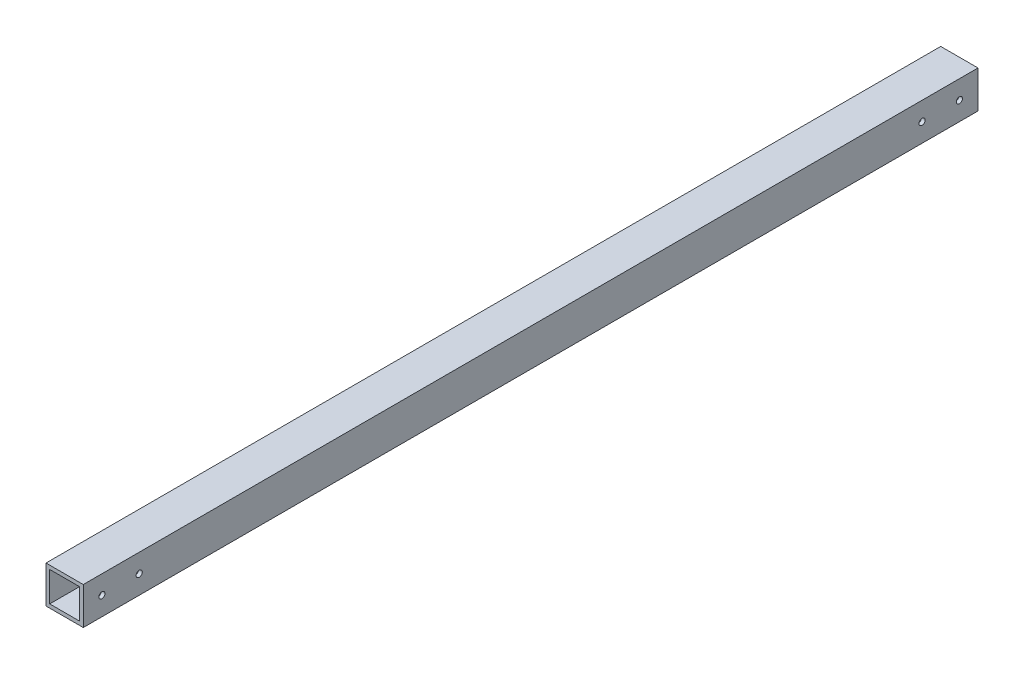
ISO-10303-21;
HEADER;
FILE_DESCRIPTION(('STEP AP214'),'2;1');
FILE_NAME('part.step','',(''),(''),'','','');
FILE_SCHEMA(('AUTOMOTIVE_DESIGN { 1 0 10303 214 1 1 1 1 }'));
ENDSEC;
DATA;
#1=APPLICATION_CONTEXT('core data for automotive mechanical design processes');
#2=APPLICATION_PROTOCOL_DEFINITION('international standard','automotive_design',2000,#1);
#3=PRODUCT_CONTEXT('',#1,'mechanical');
#4=PRODUCT('Part','Part','',(#3));
#5=PRODUCT_RELATED_PRODUCT_CATEGORY('part','',(#4));
#6=PRODUCT_DEFINITION_FORMATION('','',#4);
#7=PRODUCT_DEFINITION_CONTEXT('part definition',#1,'design');
#8=PRODUCT_DEFINITION('design','',#6,#7);
#9=PRODUCT_DEFINITION_SHAPE('','',#8);
#10=(LENGTH_UNIT() NAMED_UNIT(*) SI_UNIT(.MILLI.,.METRE.));
#11=(NAMED_UNIT(*) PLANE_ANGLE_UNIT() SI_UNIT($,.RADIAN.));
#12=(NAMED_UNIT(*) SI_UNIT($,.STERADIAN.) SOLID_ANGLE_UNIT());
#13=UNCERTAINTY_MEASURE_WITH_UNIT(LENGTH_MEASURE(1.E-05),#10,'distance_accuracy_value','');
#14=(GEOMETRIC_REPRESENTATION_CONTEXT(3) GLOBAL_UNCERTAINTY_ASSIGNED_CONTEXT((#13)) GLOBAL_UNIT_ASSIGNED_CONTEXT((#10,
#11,#12)) REPRESENTATION_CONTEXT('',''));
#15=CARTESIAN_POINT('',(0.,0.,0.));
#16=DIRECTION('',(0.,0.,1.));
#17=DIRECTION('',(1.,0.,0.));
#18=AXIS2_PLACEMENT_3D('',#15,#16,#17);
#19=CARTESIAN_POINT('',(10.,10.,560.));
#20=DIRECTION('',(-1.,0.,0.));
#21=DIRECTION('',(0.,0.,1.));
#22=AXIS2_PLACEMENT_3D('',#19,#20,#21);
#23=PLANE('',#22);
#24=CARTESIAN_POINT('',(10.,0.,50.));
#25=DIRECTION('',(1.,0.,0.));
#26=DIRECTION('',(0.,0.,-1.));
#27=AXIS2_PLACEMENT_3D('',#24,#25,#26);
#28=CIRCLE('',#27,1.64999999999999);
#29=CARTESIAN_POINT('',(10.,0.,48.35));
#30=VERTEX_POINT('',#29);
#31=EDGE_CURVE('E232',#30,#30,#28,.T.);
#32=ORIENTED_EDGE('',*,*,#31,.F.);
#33=EDGE_LOOP('',(#32));
#34=FACE_BOUND('',#33,.T.);
#35=CARTESIAN_POINT('',(10.,0.,70.));
#36=DIRECTION('',(1.,0.,0.));
#37=DIRECTION('',(0.,0.,-1.));
#38=AXIS2_PLACEMENT_3D('',#35,#36,#37);
#39=CIRCLE('',#38,1.64999999999999);
#40=CARTESIAN_POINT('',(10.,0.,68.3500000000001));
#41=VERTEX_POINT('',#40);
#42=EDGE_CURVE('E160',#41,#41,#39,.T.);
#43=ORIENTED_EDGE('',*,*,#42,.F.);
#44=EDGE_LOOP('',(#43));
#45=FACE_BOUND('',#44,.T.);
#46=CARTESIAN_POINT('',(10.,0.,490.));
#47=DIRECTION('',(1.,0.,0.));
#48=DIRECTION('',(0.,0.,-1.));
#49=AXIS2_PLACEMENT_3D('',#46,#47,#48);
#50=CIRCLE('',#49,1.64999999999999);
#51=CARTESIAN_POINT('',(10.,0.,488.35));
#52=VERTEX_POINT('',#51);
#53=EDGE_CURVE('E149',#52,#52,#50,.T.);
#54=ORIENTED_EDGE('',*,*,#53,.F.);
#55=EDGE_LOOP('',(#54));
#56=FACE_BOUND('',#55,.T.);
#57=CARTESIAN_POINT('',(10.,0.,510.));
#58=DIRECTION('',(1.,0.,0.));
#59=DIRECTION('',(0.,0.,-1.));
#60=AXIS2_PLACEMENT_3D('',#57,#58,#59);
#61=CIRCLE('',#60,1.64999999999999);
#62=CARTESIAN_POINT('',(10.,0.,508.35));
#63=VERTEX_POINT('',#62);
#64=EDGE_CURVE('E148',#63,#63,#61,.T.);
#65=ORIENTED_EDGE('',*,*,#64,.F.);
#66=EDGE_LOOP('',(#65));
#67=FACE_BOUND('',#66,.T.);
#68=DIRECTION('',(0.,1.,0.));
#69=VECTOR('',#68,1.);
#70=CARTESIAN_POINT('',(10.,10.,520.));
#71=LINE('',#70,#69);
#72=CARTESIAN_POINT('',(10.,-10.,520.));
#73=VERTEX_POINT('',#72);
#74=CARTESIAN_POINT('',(10.,10.,520.));
#75=VERTEX_POINT('',#74);
#76=EDGE_CURVE('E173',#73,#75,#71,.T.);
#77=ORIENTED_EDGE('',*,*,#76,.F.);
#78=DIRECTION('',(0.,0.,-1.));
#79=VECTOR('',#78,1.);
#80=CARTESIAN_POINT('',(10.,-10.,560.));
#81=LINE('',#80,#79);
#82=CARTESIAN_POINT('',(10.,-10.,40.));
#83=VERTEX_POINT('',#82);
#84=EDGE_CURVE('E138',#73,#83,#81,.T.);
#85=ORIENTED_EDGE('',*,*,#84,.T.);
#86=DIRECTION('',(0.,1.,0.));
#87=VECTOR('',#86,1.);
#88=CARTESIAN_POINT('',(10.,10.,40.));
#89=LINE('',#88,#87);
#90=CARTESIAN_POINT('',(10.,10.,40.));
#91=VERTEX_POINT('',#90);
#92=EDGE_CURVE('E133',#83,#91,#89,.T.);
#93=ORIENTED_EDGE('',*,*,#92,.T.);
#94=DIRECTION('',(0.,0.,-1.));
#95=VECTOR('',#94,1.);
#96=CARTESIAN_POINT('',(10.,10.,560.));
#97=LINE('',#96,#95);
#98=EDGE_CURVE('E144',#75,#91,#97,.T.);
#99=ORIENTED_EDGE('',*,*,#98,.F.);
#100=EDGE_LOOP('',(#77,#85,#93,#99));
#101=FACE_BOUND('',#100,.T.);
#102=ADVANCED_FACE('F47',(#34,#45,#56,#67,#101),#23,.F.);
#103=CARTESIAN_POINT('',(-10.,10.,560.));
#104=DIRECTION('',(0.,-1.,0.));
#105=DIRECTION('',(1.,0.,0.));
#106=AXIS2_PLACEMENT_3D('',#103,#104,#105);
#107=PLANE('',#106);
#108=DIRECTION('',(-1.,0.,0.));
#109=VECTOR('',#108,1.);
#110=CARTESIAN_POINT('',(-10.,10.,520.));
#111=LINE('',#110,#109);
#112=CARTESIAN_POINT('',(-10.,10.,520.));
#113=VERTEX_POINT('',#112);
#114=EDGE_CURVE('E171',#75,#113,#111,.T.);
#115=ORIENTED_EDGE('',*,*,#114,.F.);
#116=ORIENTED_EDGE('',*,*,#98,.T.);
#117=DIRECTION('',(-1.,0.,0.));
#118=VECTOR('',#117,1.);
#119=CARTESIAN_POINT('',(-10.,10.,40.));
#120=LINE('',#119,#118);
#121=CARTESIAN_POINT('',(-10.,10.,40.));
#122=VERTEX_POINT('',#121);
#123=EDGE_CURVE('E189',#91,#122,#120,.T.);
#124=ORIENTED_EDGE('',*,*,#123,.T.);
#125=DIRECTION('',(0.,0.,-1.));
#126=VECTOR('',#125,1.);
#127=CARTESIAN_POINT('',(-10.,10.,560.));
#128=LINE('',#127,#126);
#129=EDGE_CURVE('E142',#113,#122,#128,.T.);
#130=ORIENTED_EDGE('',*,*,#129,.F.);
#131=EDGE_LOOP('',(#115,#116,#124,#130));
#132=FACE_BOUND('',#131,.T.);
#133=ADVANCED_FACE('F210',(#132),#107,.F.);
#134=CARTESIAN_POINT('',(-10.,10.,560.));
#135=DIRECTION('',(1.,0.,0.));
#136=DIRECTION('',(0.,1.,0.));
#137=AXIS2_PLACEMENT_3D('',#134,#135,#136);
#138=PLANE('',#137);
#139=DIRECTION('',(0.,-1.,0.));
#140=VECTOR('',#139,1.);
#141=CARTESIAN_POINT('',(-10.,10.,520.));
#142=LINE('',#141,#140);
#143=CARTESIAN_POINT('',(-10.,-10.,520.));
#144=VERTEX_POINT('',#143);
#145=EDGE_CURVE('E63',#113,#144,#142,.T.);
#146=ORIENTED_EDGE('',*,*,#145,.F.);
#147=ORIENTED_EDGE('',*,*,#129,.T.);
#148=DIRECTION('',(0.,-1.,0.));
#149=VECTOR('',#148,1.);
#150=CARTESIAN_POINT('',(-10.,10.,40.));
#151=LINE('',#150,#149);
#152=CARTESIAN_POINT('',(-10.,-10.,40.));
#153=VERTEX_POINT('',#152);
#154=EDGE_CURVE('E186',#122,#153,#151,.T.);
#155=ORIENTED_EDGE('',*,*,#154,.T.);
#156=DIRECTION('',(0.,0.,-1.));
#157=VECTOR('',#156,1.);
#158=CARTESIAN_POINT('',(-10.,-10.,560.));
#159=LINE('',#158,#157);
#160=EDGE_CURVE('E140',#144,#153,#159,.T.);
#161=ORIENTED_EDGE('',*,*,#160,.F.);
#162=EDGE_LOOP('',(#146,#147,#155,#161));
#163=FACE_BOUND('',#162,.T.);
#164=ADVANCED_FACE('F206',(#163),#138,.F.);
#165=CARTESIAN_POINT('',(-10.,-10.,560.));
#166=DIRECTION('',(0.,1.,0.));
#167=DIRECTION('',(0.,0.,1.));
#168=AXIS2_PLACEMENT_3D('',#165,#166,#167);
#169=PLANE('',#168);
#170=DIRECTION('',(1.,0.,0.));
#171=VECTOR('',#170,1.);
#172=CARTESIAN_POINT('',(-10.,-10.,520.));
#173=LINE('',#172,#171);
#174=EDGE_CURVE('E168',#144,#73,#173,.T.);
#175=ORIENTED_EDGE('',*,*,#174,.F.);
#176=ORIENTED_EDGE('',*,*,#160,.T.);
#177=DIRECTION('',(1.,0.,0.));
#178=VECTOR('',#177,1.);
#179=CARTESIAN_POINT('',(-10.,-10.,40.));
#180=LINE('',#179,#178);
#181=EDGE_CURVE('E183',#153,#83,#180,.T.);
#182=ORIENTED_EDGE('',*,*,#181,.T.);
#183=ORIENTED_EDGE('',*,*,#84,.F.);
#184=EDGE_LOOP('',(#175,#176,#182,#183));
#185=FACE_BOUND('',#184,.T.);
#186=ADVANCED_FACE('F203',(#185),#169,.F.);
#187=CARTESIAN_POINT('',(8.,8.,560.));
#188=DIRECTION('',(-1.,0.,0.));
#189=DIRECTION('',(0.,0.,1.));
#190=AXIS2_PLACEMENT_3D('',#187,#188,#189);
#191=PLANE('',#190);
#192=CARTESIAN_POINT('',(8.,0.,50.));
#193=DIRECTION('',(-1.,0.,0.));
#194=DIRECTION('',(0.,0.,1.));
#195=AXIS2_PLACEMENT_3D('',#192,#193,#194);
#196=CIRCLE('',#195,1.64999999999999);
#197=CARTESIAN_POINT('',(8.,0.,51.65));
#198=VERTEX_POINT('',#197);
#199=EDGE_CURVE('E50',#198,#198,#196,.T.);
#200=ORIENTED_EDGE('',*,*,#199,.F.);
#201=EDGE_LOOP('',(#200));
#202=FACE_BOUND('',#201,.T.);
#203=CARTESIAN_POINT('',(8.,0.,70.));
#204=DIRECTION('',(-1.,0.,0.));
#205=DIRECTION('',(0.,0.,1.));
#206=AXIS2_PLACEMENT_3D('',#203,#204,#205);
#207=CIRCLE('',#206,1.64999999999999);
#208=CARTESIAN_POINT('',(8.,0.,71.65));
#209=VERTEX_POINT('',#208);
#210=EDGE_CURVE('E155',#209,#209,#207,.T.);
#211=ORIENTED_EDGE('',*,*,#210,.F.);
#212=EDGE_LOOP('',(#211));
#213=FACE_BOUND('',#212,.T.);
#214=CARTESIAN_POINT('',(8.,0.,490.));
#215=DIRECTION('',(-1.,0.,0.));
#216=DIRECTION('',(0.,0.,1.));
#217=AXIS2_PLACEMENT_3D('',#214,#215,#216);
#218=CIRCLE('',#217,1.64999999999999);
#219=CARTESIAN_POINT('',(8.,0.,491.65));
#220=VERTEX_POINT('',#219);
#221=EDGE_CURVE('E146',#220,#220,#218,.T.);
#222=ORIENTED_EDGE('',*,*,#221,.F.);
#223=EDGE_LOOP('',(#222));
#224=FACE_BOUND('',#223,.T.);
#225=CARTESIAN_POINT('',(8.,0.,510.));
#226=DIRECTION('',(-1.,0.,0.));
#227=DIRECTION('',(0.,0.,1.));
#228=AXIS2_PLACEMENT_3D('',#225,#226,#227);
#229=CIRCLE('',#228,1.64999999999999);
#230=CARTESIAN_POINT('',(8.,0.,511.65));
#231=VERTEX_POINT('',#230);
#232=EDGE_CURVE('E124',#231,#231,#229,.T.);
#233=ORIENTED_EDGE('',*,*,#232,.F.);
#234=EDGE_LOOP('',(#233));
#235=FACE_BOUND('',#234,.T.);
#236=DIRECTION('',(0.,0.,-1.));
#237=VECTOR('',#236,1.);
#238=CARTESIAN_POINT('',(8.,-8.,560.));
#239=LINE('',#238,#237);
#240=CARTESIAN_POINT('',(8.,-8.,520.));
#241=VERTEX_POINT('',#240);
#242=CARTESIAN_POINT('',(8.,-8.,40.));
#243=VERTEX_POINT('',#242);
#244=EDGE_CURVE('E129',#241,#243,#239,.T.);
#245=ORIENTED_EDGE('',*,*,#244,.F.);
#246=DIRECTION('',(0.,1.,0.));
#247=VECTOR('',#246,1.);
#248=CARTESIAN_POINT('',(8.,8.,520.));
#249=LINE('',#248,#247);
#250=CARTESIAN_POINT('',(8.,8.,520.));
#251=VERTEX_POINT('',#250);
#252=EDGE_CURVE('E71',#241,#251,#249,.T.);
#253=ORIENTED_EDGE('',*,*,#252,.T.);
#254=DIRECTION('',(0.,0.,-1.));
#255=VECTOR('',#254,1.);
#256=CARTESIAN_POINT('',(8.,8.,560.));
#257=LINE('',#256,#255);
#258=CARTESIAN_POINT('',(8.,8.,40.));
#259=VERTEX_POINT('',#258);
#260=EDGE_CURVE('E131',#251,#259,#257,.T.);
#261=ORIENTED_EDGE('',*,*,#260,.T.);
#262=DIRECTION('',(0.,1.,0.));
#263=VECTOR('',#262,1.);
#264=CARTESIAN_POINT('',(8.,8.,40.));
#265=LINE('',#264,#263);
#266=EDGE_CURVE('E180',#243,#259,#265,.T.);
#267=ORIENTED_EDGE('',*,*,#266,.F.);
#268=EDGE_LOOP('',(#245,#253,#261,#267));
#269=FACE_BOUND('',#268,.T.);
#270=ADVANCED_FACE('F314',(#202,#213,#224,#235,#269),#191,.T.);
#271=CARTESIAN_POINT('',(-8.,8.,560.));
#272=DIRECTION('',(0.,-1.,0.));
#273=DIRECTION('',(0.,0.,-1.));
#274=AXIS2_PLACEMENT_3D('',#271,#272,#273);
#275=PLANE('',#274);
#276=ORIENTED_EDGE('',*,*,#260,.F.);
#277=DIRECTION('',(-1.,0.,0.));
#278=VECTOR('',#277,1.);
#279=CARTESIAN_POINT('',(-8.,8.,520.));
#280=LINE('',#279,#278);
#281=CARTESIAN_POINT('',(-8.,8.,520.));
#282=VERTEX_POINT('',#281);
#283=EDGE_CURVE('E123',#251,#282,#280,.T.);
#284=ORIENTED_EDGE('',*,*,#283,.T.);
#285=DIRECTION('',(0.,0.,-1.));
#286=VECTOR('',#285,1.);
#287=CARTESIAN_POINT('',(-8.,8.,560.));
#288=LINE('',#287,#286);
#289=CARTESIAN_POINT('',(-8.,8.,40.));
#290=VERTEX_POINT('',#289);
#291=EDGE_CURVE('E122',#282,#290,#288,.T.);
#292=ORIENTED_EDGE('',*,*,#291,.T.);
#293=DIRECTION('',(-1.,0.,0.));
#294=VECTOR('',#293,1.);
#295=CARTESIAN_POINT('',(-8.,8.,40.));
#296=LINE('',#295,#294);
#297=EDGE_CURVE('E177',#259,#290,#296,.T.);
#298=ORIENTED_EDGE('',*,*,#297,.F.);
#299=EDGE_LOOP('',(#276,#284,#292,#298));
#300=FACE_BOUND('',#299,.T.);
#301=ADVANCED_FACE('F323',(#300),#275,.T.);
#302=CARTESIAN_POINT('',(-8.,8.,560.));
#303=DIRECTION('',(1.,0.,0.));
#304=DIRECTION('',(0.,0.,-1.));
#305=AXIS2_PLACEMENT_3D('',#302,#303,#304);
#306=PLANE('',#305);
#307=ORIENTED_EDGE('',*,*,#291,.F.);
#308=DIRECTION('',(0.,-1.,0.));
#309=VECTOR('',#308,1.);
#310=CARTESIAN_POINT('',(-8.,8.,520.));
#311=LINE('',#310,#309);
#312=CARTESIAN_POINT('',(-8.,-8.,520.));
#313=VERTEX_POINT('',#312);
#314=EDGE_CURVE('E111',#282,#313,#311,.T.);
#315=ORIENTED_EDGE('',*,*,#314,.T.);
#316=DIRECTION('',(0.,0.,-1.));
#317=VECTOR('',#316,1.);
#318=CARTESIAN_POINT('',(-8.,-8.,560.));
#319=LINE('',#318,#317);
#320=CARTESIAN_POINT('',(-8.,-8.,40.));
#321=VERTEX_POINT('',#320);
#322=EDGE_CURVE('E120',#313,#321,#319,.T.);
#323=ORIENTED_EDGE('',*,*,#322,.T.);
#324=DIRECTION('',(0.,-1.,0.));
#325=VECTOR('',#324,1.);
#326=CARTESIAN_POINT('',(-8.,8.,40.));
#327=LINE('',#326,#325);
#328=EDGE_CURVE('E175',#290,#321,#327,.T.);
#329=ORIENTED_EDGE('',*,*,#328,.F.);
#330=EDGE_LOOP('',(#307,#315,#323,#329));
#331=FACE_BOUND('',#330,.T.);
#332=ADVANCED_FACE('F118',(#331),#306,.T.);
#333=CARTESIAN_POINT('',(-8.,-8.,560.));
#334=DIRECTION('',(0.,1.,0.));
#335=DIRECTION('',(0.,0.,1.));
#336=AXIS2_PLACEMENT_3D('',#333,#334,#335);
#337=PLANE('',#336);
#338=ORIENTED_EDGE('',*,*,#322,.F.);
#339=DIRECTION('',(1.,0.,0.));
#340=VECTOR('',#339,1.);
#341=CARTESIAN_POINT('',(-8.,-8.,520.));
#342=LINE('',#341,#340);
#343=EDGE_CURVE('E12',#313,#241,#342,.T.);
#344=ORIENTED_EDGE('',*,*,#343,.T.);
#345=ORIENTED_EDGE('',*,*,#244,.T.);
#346=DIRECTION('',(1.,0.,0.));
#347=VECTOR('',#346,1.);
#348=CARTESIAN_POINT('',(-8.,-8.,40.));
#349=LINE('',#348,#347);
#350=EDGE_CURVE('E55',#321,#243,#349,.T.);
#351=ORIENTED_EDGE('',*,*,#350,.F.);
#352=EDGE_LOOP('',(#338,#344,#345,#351));
#353=FACE_BOUND('',#352,.T.);
#354=ADVANCED_FACE('F127',(#353),#337,.T.);
#355=CARTESIAN_POINT('',(0.,0.,40.));
#356=DIRECTION('',(0.,0.,1.));
#357=DIRECTION('',(1.,0.,0.));
#358=AXIS2_PLACEMENT_3D('',#355,#356,#357);
#359=PLANE('',#358);
#360=ORIENTED_EDGE('',*,*,#266,.T.);
#361=ORIENTED_EDGE('',*,*,#297,.T.);
#362=ORIENTED_EDGE('',*,*,#328,.T.);
#363=ORIENTED_EDGE('',*,*,#350,.T.);
#364=EDGE_LOOP('',(#360,#361,#362,#363));
#365=FACE_BOUND('',#364,.T.);
#366=ORIENTED_EDGE('',*,*,#181,.F.);
#367=ORIENTED_EDGE('',*,*,#154,.F.);
#368=ORIENTED_EDGE('',*,*,#123,.F.);
#369=ORIENTED_EDGE('',*,*,#92,.F.);
#370=EDGE_LOOP('',(#366,#367,#368,#369));
#371=FACE_BOUND('',#370,.T.);
#372=ADVANCED_FACE('F200',(#365,#371),#359,.F.);
#373=CARTESIAN_POINT('',(0.,0.,520.));
#374=DIRECTION('',(0.,0.,1.));
#375=DIRECTION('',(1.,0.,0.));
#376=AXIS2_PLACEMENT_3D('',#373,#374,#375);
#377=PLANE('',#376);
#378=ORIENTED_EDGE('',*,*,#343,.F.);
#379=ORIENTED_EDGE('',*,*,#314,.F.);
#380=ORIENTED_EDGE('',*,*,#283,.F.);
#381=ORIENTED_EDGE('',*,*,#252,.F.);
#382=EDGE_LOOP('',(#378,#379,#380,#381));
#383=FACE_BOUND('',#382,.T.);
#384=ORIENTED_EDGE('',*,*,#76,.T.);
#385=ORIENTED_EDGE('',*,*,#114,.T.);
#386=ORIENTED_EDGE('',*,*,#145,.T.);
#387=ORIENTED_EDGE('',*,*,#174,.T.);
#388=EDGE_LOOP('',(#384,#385,#386,#387));
#389=FACE_BOUND('',#388,.T.);
#390=ADVANCED_FACE('F110',(#383,#389),#377,.T.);
#391=CARTESIAN_POINT('',(10.,0.,510.));
#392=DIRECTION('',(1.,0.,0.));
#393=DIRECTION('',(0.,0.,-1.));
#394=AXIS2_PLACEMENT_3D('',#391,#392,#393);
#395=CYLINDRICAL_SURFACE('',#394,1.64999999999999);
#396=ORIENTED_EDGE('',*,*,#232,.T.);
#397=EDGE_LOOP('',(#396));
#398=FACE_BOUND('',#397,.T.);
#399=ORIENTED_EDGE('',*,*,#64,.T.);
#400=EDGE_LOOP('',(#399));
#401=FACE_BOUND('',#400,.T.);
#402=ADVANCED_FACE('F212',(#398,#401),#395,.F.);
#403=CARTESIAN_POINT('',(10.,0.,490.));
#404=DIRECTION('',(1.,0.,0.));
#405=DIRECTION('',(0.,0.,-1.));
#406=AXIS2_PLACEMENT_3D('',#403,#404,#405);
#407=CYLINDRICAL_SURFACE('',#406,1.64999999999999);
#408=ORIENTED_EDGE('',*,*,#221,.T.);
#409=EDGE_LOOP('',(#408));
#410=FACE_BOUND('',#409,.T.);
#411=ORIENTED_EDGE('',*,*,#53,.T.);
#412=EDGE_LOOP('',(#411));
#413=FACE_BOUND('',#412,.T.);
#414=ADVANCED_FACE('F218',(#410,#413),#407,.F.);
#415=CARTESIAN_POINT('',(10.,0.,70.));
#416=DIRECTION('',(1.,0.,0.));
#417=DIRECTION('',(0.,0.,-1.));
#418=AXIS2_PLACEMENT_3D('',#415,#416,#417);
#419=CYLINDRICAL_SURFACE('',#418,1.64999999999999);
#420=ORIENTED_EDGE('',*,*,#210,.T.);
#421=EDGE_LOOP('',(#420));
#422=FACE_BOUND('',#421,.T.);
#423=ORIENTED_EDGE('',*,*,#42,.T.);
#424=EDGE_LOOP('',(#423));
#425=FACE_BOUND('',#424,.T.);
#426=ADVANCED_FACE('F245',(#422,#425),#419,.F.);
#427=CARTESIAN_POINT('',(10.,0.,50.));
#428=DIRECTION('',(1.,0.,0.));
#429=DIRECTION('',(0.,0.,-1.));
#430=AXIS2_PLACEMENT_3D('',#427,#428,#429);
#431=CYLINDRICAL_SURFACE('',#430,1.64999999999999);
#432=ORIENTED_EDGE('',*,*,#199,.T.);
#433=EDGE_LOOP('',(#432));
#434=FACE_BOUND('',#433,.T.);
#435=ORIENTED_EDGE('',*,*,#31,.T.);
#436=EDGE_LOOP('',(#435));
#437=FACE_BOUND('',#436,.T.);
#438=ADVANCED_FACE('F243',(#434,#437),#431,.F.);
#439=CLOSED_SHELL('',(#102,#133,#164,#186,#270,#301,#332,#354,#372,#390,#402,#414,#426,#438));
#440=MANIFOLD_SOLID_BREP('B2',#439);
#441=ADVANCED_BREP_SHAPE_REPRESENTATION('',(#18,#440),#14);
#442=SHAPE_DEFINITION_REPRESENTATION(#9,#441);
ENDSEC;
END-ISO-10303-21;
